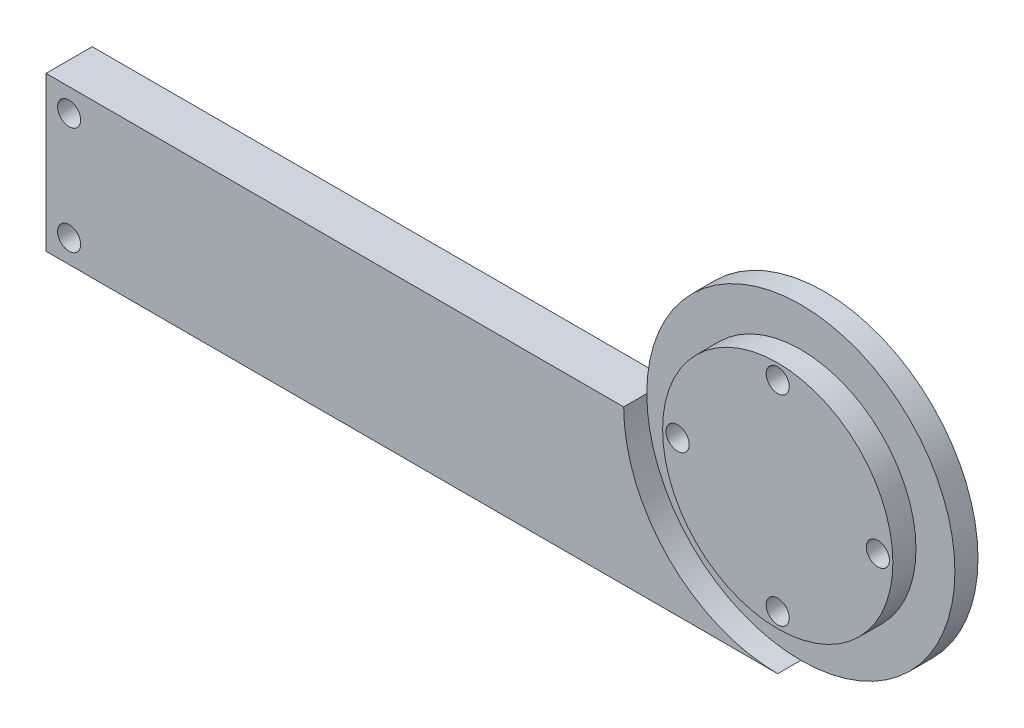
ISO-10303-21;
HEADER;
FILE_DESCRIPTION(('STEP AP214'),'2;1');
FILE_NAME('part.step','',(''),(''),'','','');
FILE_SCHEMA(('AUTOMOTIVE_DESIGN { 1 0 10303 214 1 1 1 1 }'));
ENDSEC;
DATA;
#1=APPLICATION_CONTEXT('core data for automotive mechanical design processes');
#2=APPLICATION_PROTOCOL_DEFINITION('international standard','automotive_design',2000,#1);
#3=PRODUCT_CONTEXT('',#1,'mechanical');
#4=PRODUCT('Part','Part','',(#3));
#5=PRODUCT_RELATED_PRODUCT_CATEGORY('part','',(#4));
#6=PRODUCT_DEFINITION_FORMATION('','',#4);
#7=PRODUCT_DEFINITION_CONTEXT('part definition',#1,'design');
#8=PRODUCT_DEFINITION('design','',#6,#7);
#9=PRODUCT_DEFINITION_SHAPE('','',#8);
#10=(LENGTH_UNIT() NAMED_UNIT(*) SI_UNIT(.MILLI.,.METRE.));
#11=(NAMED_UNIT(*) PLANE_ANGLE_UNIT() SI_UNIT($,.RADIAN.));
#12=(NAMED_UNIT(*) SI_UNIT($,.STERADIAN.) SOLID_ANGLE_UNIT());
#13=UNCERTAINTY_MEASURE_WITH_UNIT(LENGTH_MEASURE(1.E-05),#10,'distance_accuracy_value','');
#14=(GEOMETRIC_REPRESENTATION_CONTEXT(3) GLOBAL_UNCERTAINTY_ASSIGNED_CONTEXT((#13)) GLOBAL_UNIT_ASSIGNED_CONTEXT((#10,
#11,#12)) REPRESENTATION_CONTEXT('',''));
#15=CARTESIAN_POINT('',(0.,0.,0.));
#16=DIRECTION('',(0.,0.,1.));
#17=DIRECTION('',(1.,0.,0.));
#18=AXIS2_PLACEMENT_3D('',#15,#16,#17);
#19=CARTESIAN_POINT('',(32.9922327651456,28.0992721164614,6.));
#20=DIRECTION('',(0.,0.,-1.));
#21=DIRECTION('',(-1.,0.,0.));
#22=AXIS2_PLACEMENT_3D('',#19,#20,#21);
#23=CYLINDRICAL_SURFACE('',#22,20.);
#24=CARTESIAN_POINT('',(32.9922327651456,28.0992721164614,3.));
#25=DIRECTION('',(0.,0.,1.));
#26=DIRECTION('',(1.,0.,0.));
#27=AXIS2_PLACEMENT_3D('',#24,#25,#26);
#28=CIRCLE('',#27,20.);
#29=CARTESIAN_POINT('',(32.9922327651456,8.09927211646137,3.));
#30=VERTEX_POINT('',#29);
#31=CARTESIAN_POINT('',(12.9922327651456,28.0992721164614,3.));
#32=VERTEX_POINT('',#31);
#33=EDGE_CURVE('E123',#30,#32,#28,.T.);
#34=ORIENTED_EDGE('',*,*,#33,.F.);
#35=DIRECTION('',(0.,0.,-1.));
#36=VECTOR('',#35,1.);
#37=CARTESIAN_POINT('',(32.9922327651456,8.09927211646137,6.));
#38=LINE('',#37,#36);
#39=CARTESIAN_POINT('',(32.9922327651456,8.09927211646137,0.));
#40=VERTEX_POINT('',#39);
#41=EDGE_CURVE('E129',#30,#40,#38,.T.);
#42=ORIENTED_EDGE('',*,*,#41,.T.);
#43=CARTESIAN_POINT('',(32.9922327651456,28.0992721164614,0.));
#44=DIRECTION('',(0.,0.,1.));
#45=DIRECTION('',(1.,0.,0.));
#46=AXIS2_PLACEMENT_3D('',#43,#44,#45);
#47=CIRCLE('',#46,20.);
#48=CARTESIAN_POINT('',(12.9922327651456,28.0992721164614,0.));
#49=VERTEX_POINT('',#48);
#50=EDGE_CURVE('E94',#40,#49,#47,.T.);
#51=ORIENTED_EDGE('',*,*,#50,.T.);
#52=DIRECTION('',(0.,0.,-1.));
#53=VECTOR('',#52,1.);
#54=CARTESIAN_POINT('',(12.9922327651456,28.0992721164614,6.));
#55=LINE('',#54,#53);
#56=EDGE_CURVE('E44',#32,#49,#55,.T.);
#57=ORIENTED_EDGE('',*,*,#56,.F.);
#58=EDGE_LOOP('',(#34,#42,#51,#57));
#59=FACE_BOUND('',#58,.T.);
#60=ADVANCED_FACE('F36',(#59),#23,.T.);
#61=CARTESIAN_POINT('',(0.,28.0992721164614,6.));
#62=DIRECTION('',(0.,1.,0.));
#63=DIRECTION('',(0.,0.,1.));
#64=AXIS2_PLACEMENT_3D('',#61,#62,#63);
#65=PLANE('',#64);
#66=DIRECTION('',(1.,0.,0.));
#67=VECTOR('',#66,1.);
#68=CARTESIAN_POINT('',(0.,28.0992721164614,0.));
#69=LINE('',#68,#67);
#70=CARTESIAN_POINT('',(-62.0027952303751,28.0992721164614,0.));
#71=VERTEX_POINT('',#70);
#72=EDGE_CURVE('E84',#71,#49,#69,.T.);
#73=ORIENTED_EDGE('',*,*,#72,.F.);
#74=DIRECTION('',(0.,0.,1.));
#75=VECTOR('',#74,1.);
#76=CARTESIAN_POINT('',(-62.0027952303751,28.0992721164614,0.));
#77=LINE('',#76,#75);
#78=CARTESIAN_POINT('',(-62.0027952303751,28.0992721164614,6.));
#79=VERTEX_POINT('',#78);
#80=EDGE_CURVE('E88',#71,#79,#77,.T.);
#81=ORIENTED_EDGE('',*,*,#80,.T.);
#82=DIRECTION('',(1.,0.,0.));
#83=VECTOR('',#82,1.);
#84=CARTESIAN_POINT('',(0.,28.0992721164614,6.));
#85=LINE('',#84,#83);
#86=CARTESIAN_POINT('',(12.9922327651456,28.0992721164614,6.));
#87=VERTEX_POINT('',#86);
#88=EDGE_CURVE('E125',#79,#87,#85,.T.);
#89=ORIENTED_EDGE('',*,*,#88,.T.);
#90=EDGE_CURVE('E11',#87,#32,#55,.T.);
#91=ORIENTED_EDGE('',*,*,#90,.T.);
#92=ORIENTED_EDGE('',*,*,#56,.T.);
#93=EDGE_LOOP('',(#73,#81,#89,#91,#92));
#94=FACE_BOUND('',#93,.T.);
#95=ADVANCED_FACE('F86',(#94),#65,.T.);
#96=CARTESIAN_POINT('',(0.,8.09927211646137,6.));
#97=DIRECTION('',(0.,1.,0.));
#98=DIRECTION('',(0.,0.,1.));
#99=AXIS2_PLACEMENT_3D('',#96,#97,#98);
#100=PLANE('',#99);
#101=DIRECTION('',(1.,0.,0.));
#102=VECTOR('',#101,1.);
#103=CARTESIAN_POINT('',(0.,8.09927211646137,0.));
#104=LINE('',#103,#102);
#105=CARTESIAN_POINT('',(-62.0027952303751,8.09927211646137,0.));
#106=VERTEX_POINT('',#105);
#107=EDGE_CURVE('E93',#106,#40,#104,.T.);
#108=ORIENTED_EDGE('',*,*,#107,.T.);
#109=ORIENTED_EDGE('',*,*,#41,.F.);
#110=CARTESIAN_POINT('',(32.9922327651456,8.09927211646137,6.));
#111=VERTEX_POINT('',#110);
#112=EDGE_CURVE('E67',#111,#30,#38,.T.);
#113=ORIENTED_EDGE('',*,*,#112,.F.);
#114=DIRECTION('',(1.,0.,0.));
#115=VECTOR('',#114,1.);
#116=CARTESIAN_POINT('',(0.,8.09927211646137,6.));
#117=LINE('',#116,#115);
#118=CARTESIAN_POINT('',(-62.0027952303751,8.09927211646137,6.));
#119=VERTEX_POINT('',#118);
#120=EDGE_CURVE('E127',#119,#111,#117,.T.);
#121=ORIENTED_EDGE('',*,*,#120,.F.);
#122=DIRECTION('',(0.,0.,1.));
#123=VECTOR('',#122,1.);
#124=CARTESIAN_POINT('',(-62.0027952303751,8.09927211646137,0.));
#125=LINE('',#124,#123);
#126=EDGE_CURVE('E103',#106,#119,#125,.T.);
#127=ORIENTED_EDGE('',*,*,#126,.F.);
#128=EDGE_LOOP('',(#108,#109,#113,#121,#127));
#129=FACE_BOUND('',#128,.T.);
#130=ADVANCED_FACE('F135',(#129),#100,.F.);
#131=CARTESIAN_POINT('',(0.,0.,6.));
#132=DIRECTION('',(0.,0.,1.));
#133=DIRECTION('',(1.,0.,0.));
#134=AXIS2_PLACEMENT_3D('',#131,#132,#133);
#135=PLANE('',#134);
#136=CARTESIAN_POINT('',(-59.0027952303751,11.0992721164614,6.));
#137=DIRECTION('',(0.,0.,1.));
#138=DIRECTION('',(1.,0.,0.));
#139=AXIS2_PLACEMENT_3D('',#136,#137,#138);
#140=CIRCLE('',#139,1.5);
#141=CARTESIAN_POINT('',(-57.5027952303751,11.0992721164614,6.));
#142=VERTEX_POINT('',#141);
#143=EDGE_CURVE('E274',#142,#142,#140,.T.);
#144=ORIENTED_EDGE('',*,*,#143,.F.);
#145=EDGE_LOOP('',(#144));
#146=FACE_BOUND('',#145,.T.);
#147=CARTESIAN_POINT('',(-59.0027952303751,25.0992721164614,6.));
#148=DIRECTION('',(0.,0.,1.));
#149=DIRECTION('',(1.,0.,0.));
#150=AXIS2_PLACEMENT_3D('',#147,#148,#149);
#151=CIRCLE('',#150,1.5);
#152=CARTESIAN_POINT('',(-57.5027952303751,25.0992721164614,6.));
#153=VERTEX_POINT('',#152);
#154=EDGE_CURVE('E284',#153,#153,#151,.T.);
#155=ORIENTED_EDGE('',*,*,#154,.F.);
#156=EDGE_LOOP('',(#155));
#157=FACE_BOUND('',#156,.T.);
#158=CARTESIAN_POINT('',(32.9922327651456,28.0992721164614,6.));
#159=DIRECTION('',(0.,0.,1.));
#160=DIRECTION('',(1.,0.,0.));
#161=AXIS2_PLACEMENT_3D('',#158,#159,#160);
#162=CIRCLE('',#161,20.);
#163=EDGE_CURVE('E63',#87,#111,#162,.T.);
#164=ORIENTED_EDGE('',*,*,#163,.F.);
#165=ORIENTED_EDGE('',*,*,#88,.F.);
#166=DIRECTION('',(0.,-1.,0.));
#167=VECTOR('',#166,1.);
#168=CARTESIAN_POINT('',(-62.0027952303751,8.09927211646137,6.));
#169=LINE('',#168,#167);
#170=EDGE_CURVE('E102',#79,#119,#169,.T.);
#171=ORIENTED_EDGE('',*,*,#170,.T.);
#172=ORIENTED_EDGE('',*,*,#120,.T.);
#173=EDGE_LOOP('',(#164,#165,#171,#172));
#174=FACE_BOUND('',#173,.T.);
#175=ADVANCED_FACE('F137',(#146,#157,#174),#135,.T.);
#176=CARTESIAN_POINT('',(0.,0.,0.));
#177=DIRECTION('',(0.,0.,1.));
#178=DIRECTION('',(1.,0.,0.));
#179=AXIS2_PLACEMENT_3D('',#176,#177,#178);
#180=PLANE('',#179);
#181=CARTESIAN_POINT('',(-59.0027952303751,11.0992721164614,0.));
#182=DIRECTION('',(0.,0.,-1.));
#183=DIRECTION('',(-1.,0.,0.));
#184=AXIS2_PLACEMENT_3D('',#181,#182,#183);
#185=CIRCLE('',#184,1.5);
#186=CARTESIAN_POINT('',(-60.5027952303751,11.0992721164614,0.));
#187=VERTEX_POINT('',#186);
#188=EDGE_CURVE('E277',#187,#187,#185,.T.);
#189=ORIENTED_EDGE('',*,*,#188,.F.);
#190=EDGE_LOOP('',(#189));
#191=FACE_BOUND('',#190,.T.);
#192=CARTESIAN_POINT('',(-59.0027952303751,25.0992721164614,0.));
#193=DIRECTION('',(0.,0.,-1.));
#194=DIRECTION('',(-1.,0.,0.));
#195=AXIS2_PLACEMENT_3D('',#192,#193,#194);
#196=CIRCLE('',#195,1.5);
#197=CARTESIAN_POINT('',(-60.5027952303751,25.0992721164614,0.));
#198=VERTEX_POINT('',#197);
#199=EDGE_CURVE('E279',#198,#198,#196,.T.);
#200=ORIENTED_EDGE('',*,*,#199,.F.);
#201=EDGE_LOOP('',(#200));
#202=FACE_BOUND('',#201,.T.);
#203=CARTESIAN_POINT('',(19.9922327651456,28.0992721164614,0.));
#204=DIRECTION('',(0.,0.,1.));
#205=DIRECTION('',(1.,0.,0.));
#206=AXIS2_PLACEMENT_3D('',#203,#204,#205);
#207=CIRCLE('',#206,1.5);
#208=CARTESIAN_POINT('',(21.4922327651456,28.0992721164614,0.));
#209=VERTEX_POINT('',#208);
#210=EDGE_CURVE('E290',#209,#209,#207,.T.);
#211=ORIENTED_EDGE('',*,*,#210,.T.);
#212=EDGE_LOOP('',(#211));
#213=FACE_BOUND('',#212,.T.);
#214=CARTESIAN_POINT('',(32.9922327651456,15.0992721164614,0.));
#215=DIRECTION('',(0.,0.,1.));
#216=DIRECTION('',(1.,0.,0.));
#217=AXIS2_PLACEMENT_3D('',#214,#215,#216);
#218=CIRCLE('',#217,1.5);
#219=CARTESIAN_POINT('',(34.4922327651456,15.0992721164614,0.));
#220=VERTEX_POINT('',#219);
#221=EDGE_CURVE('E296',#220,#220,#218,.T.);
#222=ORIENTED_EDGE('',*,*,#221,.T.);
#223=EDGE_LOOP('',(#222));
#224=FACE_BOUND('',#223,.T.);
#225=CARTESIAN_POINT('',(45.9922327651456,28.0992721164614,0.));
#226=DIRECTION('',(0.,0.,1.));
#227=DIRECTION('',(1.,0.,0.));
#228=AXIS2_PLACEMENT_3D('',#225,#226,#227);
#229=CIRCLE('',#228,1.5);
#230=CARTESIAN_POINT('',(47.4922327651456,28.0992721164614,0.));
#231=VERTEX_POINT('',#230);
#232=EDGE_CURVE('E302',#231,#231,#229,.T.);
#233=ORIENTED_EDGE('',*,*,#232,.T.);
#234=EDGE_LOOP('',(#233));
#235=FACE_BOUND('',#234,.T.);
#236=CARTESIAN_POINT('',(32.9922327651456,41.0992721164614,0.));
#237=DIRECTION('',(0.,0.,1.));
#238=DIRECTION('',(1.,0.,0.));
#239=AXIS2_PLACEMENT_3D('',#236,#237,#238);
#240=CIRCLE('',#239,1.5);
#241=CARTESIAN_POINT('',(34.4922327651456,41.0992721164614,0.));
#242=VERTEX_POINT('',#241);
#243=EDGE_CURVE('E109',#242,#242,#240,.T.);
#244=ORIENTED_EDGE('',*,*,#243,.T.);
#245=EDGE_LOOP('',(#244));
#246=FACE_BOUND('',#245,.T.);
#247=ORIENTED_EDGE('',*,*,#50,.F.);
#248=ORIENTED_EDGE('',*,*,#107,.F.);
#249=DIRECTION('',(0.,-1.,0.));
#250=VECTOR('',#249,1.);
#251=CARTESIAN_POINT('',(-62.0027952303751,8.09927211646137,0.));
#252=LINE('',#251,#250);
#253=EDGE_CURVE('E100',#71,#106,#252,.T.);
#254=ORIENTED_EDGE('',*,*,#253,.F.);
#255=ORIENTED_EDGE('',*,*,#72,.T.);
#256=EDGE_LOOP('',(#247,#248,#254,#255));
#257=FACE_BOUND('',#256,.T.);
#258=ADVANCED_FACE('F105',(#191,#202,#213,#224,#235,#246,#257),#180,.F.);
#259=CARTESIAN_POINT('',(32.9922327651456,28.0992721164614,3.));
#260=DIRECTION('',(0.,0.,1.));
#261=DIRECTION('',(1.,0.,0.));
#262=AXIS2_PLACEMENT_3D('',#259,#260,#261);
#263=CYLINDRICAL_SURFACE('',#262,20.);
#264=ORIENTED_EDGE('',*,*,#90,.F.);
#265=ORIENTED_EDGE('',*,*,#163,.T.);
#266=ORIENTED_EDGE('',*,*,#112,.T.);
#267=EDGE_CURVE('E121',#32,#30,#28,.T.);
#268=ORIENTED_EDGE('',*,*,#267,.F.);
#269=EDGE_LOOP('',(#264,#265,#266,#268));
#270=FACE_BOUND('',#269,.T.);
#271=ADVANCED_FACE('F146',(#270),#263,.F.);
#272=CARTESIAN_POINT('',(32.9922327651456,28.0992721164614,3.));
#273=DIRECTION('',(0.,0.,1.));
#274=DIRECTION('',(1.,0.,0.));
#275=AXIS2_PLACEMENT_3D('',#272,#273,#274);
#276=PLANE('',#275);
#277=CARTESIAN_POINT('',(32.9922327651456,28.0992721164614,3.));
#278=DIRECTION('',(0.,0.,1.));
#279=DIRECTION('',(1.,0.,0.));
#280=AXIS2_PLACEMENT_3D('',#277,#278,#279);
#281=CIRCLE('',#280,14.95);
#282=CARTESIAN_POINT('',(47.9422327651456,28.0992721164614,3.));
#283=VERTEX_POINT('',#282);
#284=EDGE_CURVE('E116',#283,#283,#281,.T.);
#285=ORIENTED_EDGE('',*,*,#284,.F.);
#286=EDGE_LOOP('',(#285));
#287=FACE_BOUND('',#286,.T.);
#288=ORIENTED_EDGE('',*,*,#267,.T.);
#289=ORIENTED_EDGE('',*,*,#33,.T.);
#290=EDGE_LOOP('',(#288,#289));
#291=FACE_BOUND('',#290,.T.);
#292=ADVANCED_FACE('F189',(#287,#291),#276,.T.);
#293=CARTESIAN_POINT('',(32.9922327651456,28.0992721164614,3.));
#294=DIRECTION('',(0.,0.,1.));
#295=DIRECTION('',(1.,0.,0.));
#296=AXIS2_PLACEMENT_3D('',#293,#294,#295);
#297=CYLINDRICAL_SURFACE('',#296,14.95);
#298=ORIENTED_EDGE('',*,*,#284,.T.);
#299=EDGE_LOOP('',(#298));
#300=FACE_BOUND('',#299,.T.);
#301=CARTESIAN_POINT('',(32.9922327651456,28.0992721164614,6.));
#302=DIRECTION('',(0.,0.,1.));
#303=DIRECTION('',(1.,0.,0.));
#304=AXIS2_PLACEMENT_3D('',#301,#302,#303);
#305=CIRCLE('',#304,14.95);
#306=CARTESIAN_POINT('',(47.9422327651456,28.0992721164614,6.));
#307=VERTEX_POINT('',#306);
#308=EDGE_CURVE('E114',#307,#307,#305,.T.);
#309=ORIENTED_EDGE('',*,*,#308,.F.);
#310=EDGE_LOOP('',(#309));
#311=FACE_BOUND('',#310,.T.);
#312=ADVANCED_FACE('F155',(#300,#311),#297,.T.);
#313=CARTESIAN_POINT('',(19.9922327651456,28.0992721164614,6.));
#314=DIRECTION('',(0.,0.,1.));
#315=DIRECTION('',(1.,0.,0.));
#316=AXIS2_PLACEMENT_3D('',#313,#314,#315);
#317=CIRCLE('',#316,1.5);
#318=CARTESIAN_POINT('',(21.4922327651456,28.0992721164614,6.));
#319=VERTEX_POINT('',#318);
#320=EDGE_CURVE('E287',#319,#319,#317,.T.);
#321=ORIENTED_EDGE('',*,*,#320,.F.);
#322=EDGE_LOOP('',(#321));
#323=FACE_BOUND('',#322,.T.);
#324=CARTESIAN_POINT('',(32.9922327651456,15.0992721164614,6.));
#325=DIRECTION('',(0.,0.,1.));
#326=DIRECTION('',(1.,0.,0.));
#327=AXIS2_PLACEMENT_3D('',#324,#325,#326);
#328=CIRCLE('',#327,1.5);
#329=CARTESIAN_POINT('',(34.4922327651456,15.0992721164614,6.));
#330=VERTEX_POINT('',#329);
#331=EDGE_CURVE('E293',#330,#330,#328,.T.);
#332=ORIENTED_EDGE('',*,*,#331,.F.);
#333=EDGE_LOOP('',(#332));
#334=FACE_BOUND('',#333,.T.);
#335=CARTESIAN_POINT('',(45.9922327651456,28.0992721164614,6.));
#336=DIRECTION('',(0.,0.,1.));
#337=DIRECTION('',(1.,0.,0.));
#338=AXIS2_PLACEMENT_3D('',#335,#336,#337);
#339=CIRCLE('',#338,1.5);
#340=CARTESIAN_POINT('',(47.4922327651456,28.0992721164614,6.));
#341=VERTEX_POINT('',#340);
#342=EDGE_CURVE('E299',#341,#341,#339,.T.);
#343=ORIENTED_EDGE('',*,*,#342,.F.);
#344=EDGE_LOOP('',(#343));
#345=FACE_BOUND('',#344,.T.);
#346=CARTESIAN_POINT('',(32.9922327651456,41.0992721164614,6.));
#347=DIRECTION('',(0.,0.,1.));
#348=DIRECTION('',(1.,0.,0.));
#349=AXIS2_PLACEMENT_3D('',#346,#347,#348);
#350=CIRCLE('',#349,1.5);
#351=CARTESIAN_POINT('',(34.4922327651456,41.0992721164614,6.));
#352=VERTEX_POINT('',#351);
#353=EDGE_CURVE('E304',#352,#352,#350,.T.);
#354=ORIENTED_EDGE('',*,*,#353,.F.);
#355=EDGE_LOOP('',(#354));
#356=FACE_BOUND('',#355,.T.);
#357=ORIENTED_EDGE('',*,*,#308,.T.);
#358=EDGE_LOOP('',(#357));
#359=FACE_BOUND('',#358,.T.);
#360=ADVANCED_FACE('F141',(#323,#334,#345,#356,#359),#135,.T.);
#361=CARTESIAN_POINT('',(-62.0027952303751,8.09927211646137,0.));
#362=DIRECTION('',(-1.,0.,0.));
#363=DIRECTION('',(0.,0.,1.));
#364=AXIS2_PLACEMENT_3D('',#361,#362,#363);
#365=PLANE('',#364);
#366=ORIENTED_EDGE('',*,*,#170,.F.);
#367=ORIENTED_EDGE('',*,*,#80,.F.);
#368=ORIENTED_EDGE('',*,*,#253,.T.);
#369=ORIENTED_EDGE('',*,*,#126,.T.);
#370=EDGE_LOOP('',(#366,#367,#368,#369));
#371=FACE_BOUND('',#370,.T.);
#372=ADVANCED_FACE('F98',(#371),#365,.T.);
#373=CARTESIAN_POINT('',(32.9922327651456,41.0992721164614,-4.));
#374=DIRECTION('',(0.,0.,1.));
#375=DIRECTION('',(1.,0.,0.));
#376=AXIS2_PLACEMENT_3D('',#373,#374,#375);
#377=CYLINDRICAL_SURFACE('',#376,1.5);
#378=ORIENTED_EDGE('',*,*,#353,.T.);
#379=EDGE_LOOP('',(#378));
#380=FACE_BOUND('',#379,.T.);
#381=ORIENTED_EDGE('',*,*,#243,.F.);
#382=EDGE_LOOP('',(#381));
#383=FACE_BOUND('',#382,.T.);
#384=ADVANCED_FACE('F212',(#380,#383),#377,.F.);
#385=CARTESIAN_POINT('',(45.9922327651456,28.0992721164614,-4.));
#386=DIRECTION('',(0.,0.,1.));
#387=DIRECTION('',(1.,0.,0.));
#388=AXIS2_PLACEMENT_3D('',#385,#386,#387);
#389=CYLINDRICAL_SURFACE('',#388,1.5);
#390=ORIENTED_EDGE('',*,*,#342,.T.);
#391=EDGE_LOOP('',(#390));
#392=FACE_BOUND('',#391,.T.);
#393=ORIENTED_EDGE('',*,*,#232,.F.);
#394=EDGE_LOOP('',(#393));
#395=FACE_BOUND('',#394,.T.);
#396=ADVANCED_FACE('F217',(#392,#395),#389,.F.);
#397=CARTESIAN_POINT('',(32.9922327651456,15.0992721164614,-4.));
#398=DIRECTION('',(0.,0.,1.));
#399=DIRECTION('',(1.,0.,0.));
#400=AXIS2_PLACEMENT_3D('',#397,#398,#399);
#401=CYLINDRICAL_SURFACE('',#400,1.5);
#402=ORIENTED_EDGE('',*,*,#331,.T.);
#403=EDGE_LOOP('',(#402));
#404=FACE_BOUND('',#403,.T.);
#405=ORIENTED_EDGE('',*,*,#221,.F.);
#406=EDGE_LOOP('',(#405));
#407=FACE_BOUND('',#406,.T.);
#408=ADVANCED_FACE('F225',(#404,#407),#401,.F.);
#409=CARTESIAN_POINT('',(19.9922327651456,28.0992721164614,-4.));
#410=DIRECTION('',(0.,0.,1.));
#411=DIRECTION('',(1.,0.,0.));
#412=AXIS2_PLACEMENT_3D('',#409,#410,#411);
#413=CYLINDRICAL_SURFACE('',#412,1.5);
#414=ORIENTED_EDGE('',*,*,#320,.T.);
#415=EDGE_LOOP('',(#414));
#416=FACE_BOUND('',#415,.T.);
#417=ORIENTED_EDGE('',*,*,#210,.F.);
#418=EDGE_LOOP('',(#417));
#419=FACE_BOUND('',#418,.T.);
#420=ADVANCED_FACE('F233',(#416,#419),#413,.F.);
#421=CARTESIAN_POINT('',(-59.0027952303751,25.0992721164614,10.));
#422=DIRECTION('',(0.,0.,-1.));
#423=DIRECTION('',(-1.,0.,0.));
#424=AXIS2_PLACEMENT_3D('',#421,#422,#423);
#425=CYLINDRICAL_SURFACE('',#424,1.5);
#426=ORIENTED_EDGE('',*,*,#154,.T.);
#427=EDGE_LOOP('',(#426));
#428=FACE_BOUND('',#427,.T.);
#429=ORIENTED_EDGE('',*,*,#199,.T.);
#430=EDGE_LOOP('',(#429));
#431=FACE_BOUND('',#430,.T.);
#432=ADVANCED_FACE('F240',(#428,#431),#425,.F.);
#433=CARTESIAN_POINT('',(-59.0027952303751,11.0992721164614,10.));
#434=DIRECTION('',(0.,0.,-1.));
#435=DIRECTION('',(-1.,0.,0.));
#436=AXIS2_PLACEMENT_3D('',#433,#434,#435);
#437=CYLINDRICAL_SURFACE('',#436,1.5);
#438=ORIENTED_EDGE('',*,*,#143,.T.);
#439=EDGE_LOOP('',(#438));
#440=FACE_BOUND('',#439,.T.);
#441=ORIENTED_EDGE('',*,*,#188,.T.);
#442=EDGE_LOOP('',(#441));
#443=FACE_BOUND('',#442,.T.);
#444=ADVANCED_FACE('F247',(#440,#443),#437,.F.);
#445=CLOSED_SHELL('',(#60,#95,#130,#175,#258,#271,#292,#312,#360,#372,#384,#396,#408,#420,#432,#444));
#446=MANIFOLD_SOLID_BREP('B2',#445);
#447=ADVANCED_BREP_SHAPE_REPRESENTATION('',(#18,#446),#14);
#448=SHAPE_DEFINITION_REPRESENTATION(#9,#447);
ENDSEC;
END-ISO-10303-21;
